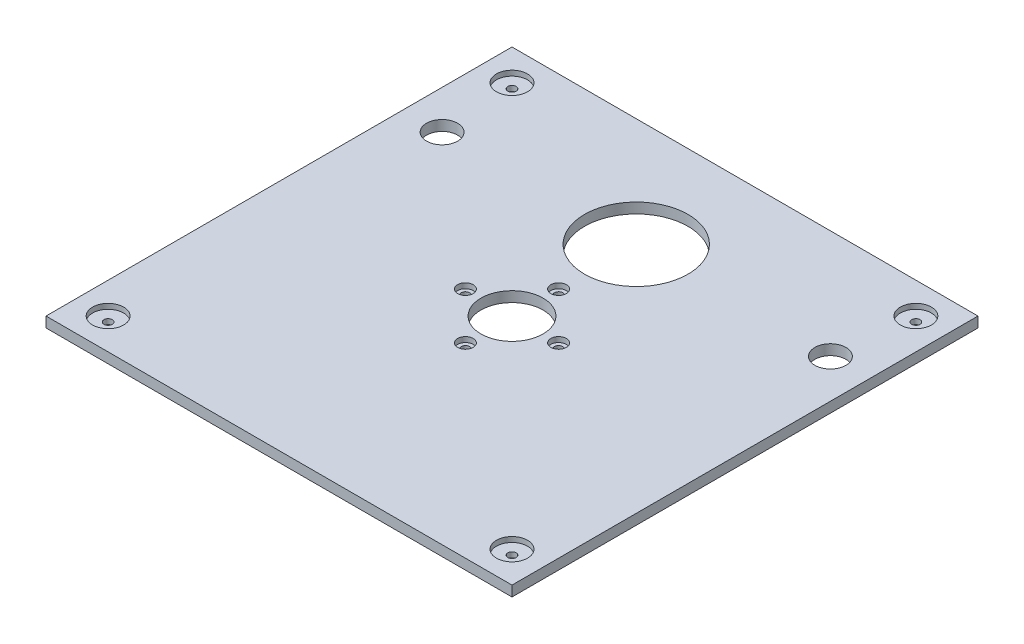
ISO-10303-21;
HEADER;
FILE_DESCRIPTION(('STEP AP214'),'2;1');
FILE_NAME('part.step','',(''),(''),'','','');
FILE_SCHEMA(('AUTOMOTIVE_DESIGN { 1 0 10303 214 1 1 1 1 }'));
ENDSEC;
DATA;
#1=APPLICATION_CONTEXT('core data for automotive mechanical design processes');
#2=APPLICATION_PROTOCOL_DEFINITION('international standard','automotive_design',2000,#1);
#3=PRODUCT_CONTEXT('',#1,'mechanical');
#4=PRODUCT('Part','Part','',(#3));
#5=PRODUCT_RELATED_PRODUCT_CATEGORY('part','',(#4));
#6=PRODUCT_DEFINITION_FORMATION('','',#4);
#7=PRODUCT_DEFINITION_CONTEXT('part definition',#1,'design');
#8=PRODUCT_DEFINITION('design','',#6,#7);
#9=PRODUCT_DEFINITION_SHAPE('','',#8);
#10=(LENGTH_UNIT() NAMED_UNIT(*) SI_UNIT(.MILLI.,.METRE.));
#11=(NAMED_UNIT(*) PLANE_ANGLE_UNIT() SI_UNIT($,.RADIAN.));
#12=(NAMED_UNIT(*) SI_UNIT($,.STERADIAN.) SOLID_ANGLE_UNIT());
#13=UNCERTAINTY_MEASURE_WITH_UNIT(LENGTH_MEASURE(1.E-05),#10,'distance_accuracy_value','');
#14=(GEOMETRIC_REPRESENTATION_CONTEXT(3) GLOBAL_UNCERTAINTY_ASSIGNED_CONTEXT((#13)) GLOBAL_UNIT_ASSIGNED_CONTEXT((#10,
#11,#12)) REPRESENTATION_CONTEXT('',''));
#15=CARTESIAN_POINT('',(0.,0.,0.));
#16=DIRECTION('',(0.,0.,1.));
#17=DIRECTION('',(1.,0.,0.));
#18=AXIS2_PLACEMENT_3D('',#15,#16,#17);
#19=CARTESIAN_POINT('',(0.,10.,0.));
#20=DIRECTION('',(0.,-1.,0.));
#21=DIRECTION('',(0.,0.,-1.));
#22=AXIS2_PLACEMENT_3D('',#19,#20,#21);
#23=PLANE('',#22);
#24=CARTESIAN_POINT('',(195.,10.,-195.));
#25=DIRECTION('',(0.,1.,0.));
#26=DIRECTION('',(0.,0.,1.));
#27=AXIS2_PLACEMENT_3D('',#24,#25,#26);
#28=CIRCLE('',#27,15.);
#29=CARTESIAN_POINT('',(195.,10.,-180.));
#30=VERTEX_POINT('',#29);
#31=EDGE_CURVE('E174',#30,#30,#28,.T.);
#32=ORIENTED_EDGE('',*,*,#31,.F.);
#33=EDGE_LOOP('',(#32));
#34=FACE_BOUND('',#33,.T.);
#35=CARTESIAN_POINT('',(195.,10.,195.));
#36=DIRECTION('',(0.,1.,0.));
#37=DIRECTION('',(0.,0.,1.));
#38=AXIS2_PLACEMENT_3D('',#35,#36,#37);
#39=CIRCLE('',#38,15.);
#40=CARTESIAN_POINT('',(195.,10.,210.));
#41=VERTEX_POINT('',#40);
#42=EDGE_CURVE('E199',#41,#41,#39,.T.);
#43=ORIENTED_EDGE('',*,*,#42,.F.);
#44=EDGE_LOOP('',(#43));
#45=FACE_BOUND('',#44,.T.);
#46=CARTESIAN_POINT('',(-195.,10.,195.));
#47=DIRECTION('',(0.,1.,0.));
#48=DIRECTION('',(0.,0.,1.));
#49=AXIS2_PLACEMENT_3D('',#46,#47,#48);
#50=CIRCLE('',#49,15.);
#51=CARTESIAN_POINT('',(-195.,10.,210.));
#52=VERTEX_POINT('',#51);
#53=EDGE_CURVE('E191',#52,#52,#50,.T.);
#54=ORIENTED_EDGE('',*,*,#53,.F.);
#55=EDGE_LOOP('',(#54));
#56=FACE_BOUND('',#55,.T.);
#57=CARTESIAN_POINT('',(-45.,10.,0.));
#58=DIRECTION('',(0.,1.,0.));
#59=DIRECTION('',(0.,0.,1.));
#60=AXIS2_PLACEMENT_3D('',#57,#58,#59);
#61=CIRCLE('',#60,7.50000000000001);
#62=CARTESIAN_POINT('',(-45.,10.,7.50000000000001));
#63=VERTEX_POINT('',#62);
#64=EDGE_CURVE('E182',#63,#63,#61,.T.);
#65=ORIENTED_EDGE('',*,*,#64,.F.);
#66=EDGE_LOOP('',(#65));
#67=FACE_BOUND('',#66,.T.);
#68=CARTESIAN_POINT('',(0.,10.,-45.));
#69=DIRECTION('',(0.,1.,0.));
#70=DIRECTION('',(0.,0.,1.));
#71=AXIS2_PLACEMENT_3D('',#68,#69,#70);
#72=CIRCLE('',#71,7.5);
#73=CARTESIAN_POINT('',(0.,10.,-37.5));
#74=VERTEX_POINT('',#73);
#75=EDGE_CURVE('E183',#74,#74,#72,.T.);
#76=ORIENTED_EDGE('',*,*,#75,.F.);
#77=EDGE_LOOP('',(#76));
#78=FACE_BOUND('',#77,.T.);
#79=CARTESIAN_POINT('',(0.,10.,45.));
#80=DIRECTION('',(0.,1.,0.));
#81=DIRECTION('',(0.,0.,1.));
#82=AXIS2_PLACEMENT_3D('',#79,#80,#81);
#83=CIRCLE('',#82,7.5);
#84=CARTESIAN_POINT('',(0.,10.,52.5));
#85=VERTEX_POINT('',#84);
#86=EDGE_CURVE('E223',#85,#85,#83,.T.);
#87=ORIENTED_EDGE('',*,*,#86,.F.);
#88=EDGE_LOOP('',(#87));
#89=FACE_BOUND('',#88,.T.);
#90=CARTESIAN_POINT('',(45.,10.,0.));
#91=DIRECTION('',(0.,1.,0.));
#92=DIRECTION('',(0.,0.,1.));
#93=AXIS2_PLACEMENT_3D('',#90,#91,#92);
#94=CIRCLE('',#93,7.50000000000001);
#95=CARTESIAN_POINT('',(45.,10.,7.50000000000001));
#96=VERTEX_POINT('',#95);
#97=EDGE_CURVE('E214',#96,#96,#94,.T.);
#98=ORIENTED_EDGE('',*,*,#97,.F.);
#99=EDGE_LOOP('',(#98));
#100=FACE_BOUND('',#99,.T.);
#101=CARTESIAN_POINT('',(-195.,10.,-195.));
#102=DIRECTION('',(0.,1.,0.));
#103=DIRECTION('',(0.,0.,1.));
#104=AXIS2_PLACEMENT_3D('',#101,#102,#103);
#105=CIRCLE('',#104,15.);
#106=CARTESIAN_POINT('',(-195.,10.,-180.));
#107=VERTEX_POINT('',#106);
#108=EDGE_CURVE('E170',#107,#107,#105,.T.);
#109=ORIENTED_EDGE('',*,*,#108,.F.);
#110=EDGE_LOOP('',(#109));
#111=FACE_BOUND('',#110,.T.);
#112=DIRECTION('',(0.,0.,-1.));
#113=VECTOR('',#112,1.);
#114=CARTESIAN_POINT('',(225.,10.,225.));
#115=LINE('',#114,#113);
#116=CARTESIAN_POINT('',(225.,10.,225.));
#117=VERTEX_POINT('',#116);
#118=CARTESIAN_POINT('',(225.,10.,-225.));
#119=VERTEX_POINT('',#118);
#120=EDGE_CURVE('E100',#117,#119,#115,.T.);
#121=ORIENTED_EDGE('',*,*,#120,.T.);
#122=DIRECTION('',(-1.,0.,0.));
#123=VECTOR('',#122,1.);
#124=CARTESIAN_POINT('',(-225.,10.,-225.));
#125=LINE('',#124,#123);
#126=CARTESIAN_POINT('',(-225.,10.,-225.));
#127=VERTEX_POINT('',#126);
#128=EDGE_CURVE('E95',#119,#127,#125,.T.);
#129=ORIENTED_EDGE('',*,*,#128,.T.);
#130=DIRECTION('',(0.,0.,1.));
#131=VECTOR('',#130,1.);
#132=CARTESIAN_POINT('',(-225.,10.,225.));
#133=LINE('',#132,#131);
#134=CARTESIAN_POINT('',(-225.,10.,225.));
#135=VERTEX_POINT('',#134);
#136=EDGE_CURVE('E98',#127,#135,#133,.T.);
#137=ORIENTED_EDGE('',*,*,#136,.T.);
#138=DIRECTION('',(1.,0.,0.));
#139=VECTOR('',#138,1.);
#140=CARTESIAN_POINT('',(-225.,10.,225.));
#141=LINE('',#140,#139);
#142=EDGE_CURVE('E65',#135,#117,#141,.T.);
#143=ORIENTED_EDGE('',*,*,#142,.T.);
#144=EDGE_LOOP('',(#121,#129,#137,#143));
#145=FACE_BOUND('',#144,.T.);
#146=CARTESIAN_POINT('',(0.,10.,0.));
#147=DIRECTION('',(0.,1.,0.));
#148=DIRECTION('',(0.,0.,1.));
#149=AXIS2_PLACEMENT_3D('',#146,#147,#148);
#150=CIRCLE('',#149,30.);
#151=CARTESIAN_POINT('',(0.,10.,30.));
#152=VERTEX_POINT('',#151);
#153=EDGE_CURVE('E120',#152,#152,#150,.T.);
#154=ORIENTED_EDGE('',*,*,#153,.F.);
#155=EDGE_LOOP('',(#154));
#156=FACE_BOUND('',#155,.T.);
#157=CARTESIAN_POINT('',(0.,10.,-120.));
#158=DIRECTION('',(0.,1.,0.));
#159=DIRECTION('',(0.,0.,1.));
#160=AXIS2_PLACEMENT_3D('',#157,#158,#159);
#161=CIRCLE('',#160,50.);
#162=CARTESIAN_POINT('',(0.,10.,-70.));
#163=VERTEX_POINT('',#162);
#164=EDGE_CURVE('E142',#163,#163,#161,.T.);
#165=ORIENTED_EDGE('',*,*,#164,.F.);
#166=EDGE_LOOP('',(#165));
#167=FACE_BOUND('',#166,.T.);
#168=CARTESIAN_POINT('',(-187.5,10.,-120.));
#169=DIRECTION('',(0.,1.,0.));
#170=DIRECTION('',(0.,0.,1.));
#171=AXIS2_PLACEMENT_3D('',#168,#169,#170);
#172=CIRCLE('',#171,15.);
#173=CARTESIAN_POINT('',(-187.5,10.,-105.));
#174=VERTEX_POINT('',#173);
#175=EDGE_CURVE('E150',#174,#174,#172,.T.);
#176=ORIENTED_EDGE('',*,*,#175,.F.);
#177=EDGE_LOOP('',(#176));
#178=FACE_BOUND('',#177,.T.);
#179=CARTESIAN_POINT('',(187.5,10.,-120.));
#180=DIRECTION('',(0.,1.,0.));
#181=DIRECTION('',(0.,0.,1.));
#182=AXIS2_PLACEMENT_3D('',#179,#180,#181);
#183=CIRCLE('',#182,15.);
#184=CARTESIAN_POINT('',(187.5,10.,-105.));
#185=VERTEX_POINT('',#184);
#186=EDGE_CURVE('E158',#185,#185,#183,.T.);
#187=ORIENTED_EDGE('',*,*,#186,.F.);
#188=EDGE_LOOP('',(#187));
#189=FACE_BOUND('',#188,.T.);
#190=ADVANCED_FACE('F47',(#34,#45,#56,#67,#78,#89,#100,#111,#145,#156,#167,#178,#189),#23,.F.);
#191=CARTESIAN_POINT('',(0.,0.,0.));
#192=DIRECTION('',(0.,-1.,0.));
#193=DIRECTION('',(0.,0.,-1.));
#194=AXIS2_PLACEMENT_3D('',#191,#192,#193);
#195=PLANE('',#194);
#196=CARTESIAN_POINT('',(-195.,0.,-195.));
#197=DIRECTION('',(0.,1.,0.));
#198=DIRECTION('',(0.,0.,1.));
#199=AXIS2_PLACEMENT_3D('',#196,#197,#198);
#200=CIRCLE('',#199,3.99999999999999);
#201=CARTESIAN_POINT('',(-195.,0.,-191.));
#202=VERTEX_POINT('',#201);
#203=EDGE_CURVE('E242',#202,#202,#200,.T.);
#204=ORIENTED_EDGE('',*,*,#203,.T.);
#205=EDGE_LOOP('',(#204));
#206=FACE_BOUND('',#205,.T.);
#207=CARTESIAN_POINT('',(195.,0.,-195.));
#208=DIRECTION('',(0.,1.,0.));
#209=DIRECTION('',(0.,0.,1.));
#210=AXIS2_PLACEMENT_3D('',#207,#208,#209);
#211=CIRCLE('',#210,3.99999999999999);
#212=CARTESIAN_POINT('',(195.,0.,-191.));
#213=VERTEX_POINT('',#212);
#214=EDGE_CURVE('E250',#213,#213,#211,.T.);
#215=ORIENTED_EDGE('',*,*,#214,.T.);
#216=EDGE_LOOP('',(#215));
#217=FACE_BOUND('',#216,.T.);
#218=CARTESIAN_POINT('',(0.,0.,-45.));
#219=DIRECTION('',(0.,1.,0.));
#220=DIRECTION('',(0.,0.,1.));
#221=AXIS2_PLACEMENT_3D('',#218,#219,#220);
#222=CIRCLE('',#221,4.);
#223=CARTESIAN_POINT('',(0.,0.,-41.));
#224=VERTEX_POINT('',#223);
#225=EDGE_CURVE('E258',#224,#224,#222,.T.);
#226=ORIENTED_EDGE('',*,*,#225,.T.);
#227=EDGE_LOOP('',(#226));
#228=FACE_BOUND('',#227,.T.);
#229=CARTESIAN_POINT('',(0.,0.,45.));
#230=DIRECTION('',(0.,1.,0.));
#231=DIRECTION('',(0.,0.,1.));
#232=AXIS2_PLACEMENT_3D('',#229,#230,#231);
#233=CIRCLE('',#232,4.);
#234=CARTESIAN_POINT('',(0.,0.,49.));
#235=VERTEX_POINT('',#234);
#236=EDGE_CURVE('E266',#235,#235,#233,.T.);
#237=ORIENTED_EDGE('',*,*,#236,.T.);
#238=EDGE_LOOP('',(#237));
#239=FACE_BOUND('',#238,.T.);
#240=CARTESIAN_POINT('',(45.,0.,0.));
#241=DIRECTION('',(0.,1.,0.));
#242=DIRECTION('',(0.,0.,1.));
#243=AXIS2_PLACEMENT_3D('',#240,#241,#242);
#244=CIRCLE('',#243,4.00000000000001);
#245=CARTESIAN_POINT('',(45.,0.,4.00000000000001));
#246=VERTEX_POINT('',#245);
#247=EDGE_CURVE('E274',#246,#246,#244,.T.);
#248=ORIENTED_EDGE('',*,*,#247,.T.);
#249=EDGE_LOOP('',(#248));
#250=FACE_BOUND('',#249,.T.);
#251=CARTESIAN_POINT('',(-45.,0.,0.));
#252=DIRECTION('',(0.,1.,0.));
#253=DIRECTION('',(0.,0.,1.));
#254=AXIS2_PLACEMENT_3D('',#251,#252,#253);
#255=CIRCLE('',#254,4.00000000000001);
#256=CARTESIAN_POINT('',(-45.,0.,4.00000000000001));
#257=VERTEX_POINT('',#256);
#258=EDGE_CURVE('E282',#257,#257,#255,.T.);
#259=ORIENTED_EDGE('',*,*,#258,.T.);
#260=EDGE_LOOP('',(#259));
#261=FACE_BOUND('',#260,.T.);
#262=CARTESIAN_POINT('',(-195.,0.,195.));
#263=DIRECTION('',(0.,1.,0.));
#264=DIRECTION('',(0.,0.,1.));
#265=AXIS2_PLACEMENT_3D('',#262,#263,#264);
#266=CIRCLE('',#265,3.99999999999999);
#267=CARTESIAN_POINT('',(-195.,0.,199.));
#268=VERTEX_POINT('',#267);
#269=EDGE_CURVE('E290',#268,#268,#266,.T.);
#270=ORIENTED_EDGE('',*,*,#269,.T.);
#271=EDGE_LOOP('',(#270));
#272=FACE_BOUND('',#271,.T.);
#273=CARTESIAN_POINT('',(195.,0.,195.));
#274=DIRECTION('',(0.,1.,0.));
#275=DIRECTION('',(0.,0.,1.));
#276=AXIS2_PLACEMENT_3D('',#273,#274,#275);
#277=CIRCLE('',#276,3.99999999999999);
#278=CARTESIAN_POINT('',(195.,0.,199.));
#279=VERTEX_POINT('',#278);
#280=EDGE_CURVE('E215',#279,#279,#277,.T.);
#281=ORIENTED_EDGE('',*,*,#280,.T.);
#282=EDGE_LOOP('',(#281));
#283=FACE_BOUND('',#282,.T.);
#284=CARTESIAN_POINT('',(-187.5,0.,-120.));
#285=DIRECTION('',(0.,1.,0.));
#286=DIRECTION('',(0.,0.,1.));
#287=AXIS2_PLACEMENT_3D('',#284,#285,#286);
#288=CIRCLE('',#287,15.);
#289=CARTESIAN_POINT('',(-187.5,0.,-105.));
#290=VERTEX_POINT('',#289);
#291=EDGE_CURVE('E154',#290,#290,#288,.T.);
#292=ORIENTED_EDGE('',*,*,#291,.T.);
#293=EDGE_LOOP('',(#292));
#294=FACE_BOUND('',#293,.T.);
#295=CARTESIAN_POINT('',(0.,0.,0.));
#296=DIRECTION('',(0.,1.,0.));
#297=DIRECTION('',(0.,0.,1.));
#298=AXIS2_PLACEMENT_3D('',#295,#296,#297);
#299=CIRCLE('',#298,30.);
#300=CARTESIAN_POINT('',(0.,0.,30.));
#301=VERTEX_POINT('',#300);
#302=EDGE_CURVE('E138',#301,#301,#299,.T.);
#303=ORIENTED_EDGE('',*,*,#302,.T.);
#304=EDGE_LOOP('',(#303));
#305=FACE_BOUND('',#304,.T.);
#306=DIRECTION('',(0.,0.,-1.));
#307=VECTOR('',#306,1.);
#308=CARTESIAN_POINT('',(225.,0.,225.));
#309=LINE('',#308,#307);
#310=CARTESIAN_POINT('',(225.,0.,225.));
#311=VERTEX_POINT('',#310);
#312=CARTESIAN_POINT('',(225.,0.,-225.));
#313=VERTEX_POINT('',#312);
#314=EDGE_CURVE('E116',#311,#313,#309,.T.);
#315=ORIENTED_EDGE('',*,*,#314,.F.);
#316=DIRECTION('',(1.,0.,0.));
#317=VECTOR('',#316,1.);
#318=CARTESIAN_POINT('',(-225.,0.,225.));
#319=LINE('',#318,#317);
#320=CARTESIAN_POINT('',(-225.,0.,225.));
#321=VERTEX_POINT('',#320);
#322=EDGE_CURVE('E88',#321,#311,#319,.T.);
#323=ORIENTED_EDGE('',*,*,#322,.F.);
#324=DIRECTION('',(0.,0.,1.));
#325=VECTOR('',#324,1.);
#326=CARTESIAN_POINT('',(-225.,0.,225.));
#327=LINE('',#326,#325);
#328=CARTESIAN_POINT('',(-225.,0.,-225.));
#329=VERTEX_POINT('',#328);
#330=EDGE_CURVE('E82',#329,#321,#327,.T.);
#331=ORIENTED_EDGE('',*,*,#330,.F.);
#332=DIRECTION('',(-1.,0.,0.));
#333=VECTOR('',#332,1.);
#334=CARTESIAN_POINT('',(-225.,0.,-225.));
#335=LINE('',#334,#333);
#336=EDGE_CURVE('E105',#313,#329,#335,.T.);
#337=ORIENTED_EDGE('',*,*,#336,.F.);
#338=EDGE_LOOP('',(#315,#323,#331,#337));
#339=FACE_BOUND('',#338,.T.);
#340=CARTESIAN_POINT('',(0.,0.,-120.));
#341=DIRECTION('',(0.,1.,0.));
#342=DIRECTION('',(0.,0.,1.));
#343=AXIS2_PLACEMENT_3D('',#340,#341,#342);
#344=CIRCLE('',#343,50.);
#345=CARTESIAN_POINT('',(0.,0.,-70.));
#346=VERTEX_POINT('',#345);
#347=EDGE_CURVE('E146',#346,#346,#344,.T.);
#348=ORIENTED_EDGE('',*,*,#347,.T.);
#349=EDGE_LOOP('',(#348));
#350=FACE_BOUND('',#349,.T.);
#351=CARTESIAN_POINT('',(187.5,0.,-120.));
#352=DIRECTION('',(0.,1.,0.));
#353=DIRECTION('',(0.,0.,1.));
#354=AXIS2_PLACEMENT_3D('',#351,#352,#353);
#355=CIRCLE('',#354,15.);
#356=CARTESIAN_POINT('',(187.5,0.,-105.));
#357=VERTEX_POINT('',#356);
#358=EDGE_CURVE('E162',#357,#357,#355,.T.);
#359=ORIENTED_EDGE('',*,*,#358,.T.);
#360=EDGE_LOOP('',(#359));
#361=FACE_BOUND('',#360,.T.);
#362=ADVANCED_FACE('F133',(#206,#217,#228,#239,#250,#261,#272,#283,#294,#305,#339,#350,#361),
#195,.T.);
#363=CARTESIAN_POINT('',(225.,10.,225.));
#364=DIRECTION('',(-1.,0.,0.));
#365=DIRECTION('',(0.,0.,1.));
#366=AXIS2_PLACEMENT_3D('',#363,#364,#365);
#367=PLANE('',#366);
#368=ORIENTED_EDGE('',*,*,#314,.T.);
#369=DIRECTION('',(0.,-1.,0.));
#370=VECTOR('',#369,1.);
#371=CARTESIAN_POINT('',(225.,10.,-225.));
#372=LINE('',#371,#370);
#373=EDGE_CURVE('E11',#119,#313,#372,.T.);
#374=ORIENTED_EDGE('',*,*,#373,.F.);
#375=ORIENTED_EDGE('',*,*,#120,.F.);
#376=DIRECTION('',(0.,-1.,0.));
#377=VECTOR('',#376,1.);
#378=CARTESIAN_POINT('',(225.,10.,225.));
#379=LINE('',#378,#377);
#380=EDGE_CURVE('E112',#117,#311,#379,.T.);
#381=ORIENTED_EDGE('',*,*,#380,.T.);
#382=EDGE_LOOP('',(#368,#374,#375,#381));
#383=FACE_BOUND('',#382,.T.);
#384=ADVANCED_FACE('F49',(#383),#367,.F.);
#385=CARTESIAN_POINT('',(-225.,10.,-225.));
#386=DIRECTION('',(0.,0.,1.));
#387=DIRECTION('',(1.,0.,0.));
#388=AXIS2_PLACEMENT_3D('',#385,#386,#387);
#389=PLANE('',#388);
#390=ORIENTED_EDGE('',*,*,#336,.T.);
#391=DIRECTION('',(0.,-1.,0.));
#392=VECTOR('',#391,1.);
#393=CARTESIAN_POINT('',(-225.,10.,-225.));
#394=LINE('',#393,#392);
#395=EDGE_CURVE('E57',#127,#329,#394,.T.);
#396=ORIENTED_EDGE('',*,*,#395,.F.);
#397=ORIENTED_EDGE('',*,*,#128,.F.);
#398=ORIENTED_EDGE('',*,*,#373,.T.);
#399=EDGE_LOOP('',(#390,#396,#397,#398));
#400=FACE_BOUND('',#399,.T.);
#401=ADVANCED_FACE('F104',(#400),#389,.F.);
#402=CARTESIAN_POINT('',(-225.,10.,225.));
#403=DIRECTION('',(1.,0.,0.));
#404=DIRECTION('',(0.,0.,-1.));
#405=AXIS2_PLACEMENT_3D('',#402,#403,#404);
#406=PLANE('',#405);
#407=ORIENTED_EDGE('',*,*,#330,.T.);
#408=DIRECTION('',(0.,-1.,0.));
#409=VECTOR('',#408,1.);
#410=CARTESIAN_POINT('',(-225.,10.,225.));
#411=LINE('',#410,#409);
#412=EDGE_CURVE('E107',#135,#321,#411,.T.);
#413=ORIENTED_EDGE('',*,*,#412,.F.);
#414=ORIENTED_EDGE('',*,*,#136,.F.);
#415=ORIENTED_EDGE('',*,*,#395,.T.);
#416=EDGE_LOOP('',(#407,#413,#414,#415));
#417=FACE_BOUND('',#416,.T.);
#418=ADVANCED_FACE('F108',(#417),#406,.F.);
#419=CARTESIAN_POINT('',(-225.,10.,225.));
#420=DIRECTION('',(0.,0.,-1.));
#421=DIRECTION('',(-1.,0.,0.));
#422=AXIS2_PLACEMENT_3D('',#419,#420,#421);
#423=PLANE('',#422);
#424=ORIENTED_EDGE('',*,*,#322,.T.);
#425=ORIENTED_EDGE('',*,*,#380,.F.);
#426=ORIENTED_EDGE('',*,*,#142,.F.);
#427=ORIENTED_EDGE('',*,*,#412,.T.);
#428=EDGE_LOOP('',(#424,#425,#426,#427));
#429=FACE_BOUND('',#428,.T.);
#430=ADVANCED_FACE('F130',(#429),#423,.F.);
#431=CARTESIAN_POINT('',(0.,10.,0.));
#432=DIRECTION('',(0.,-1.,0.));
#433=DIRECTION('',(0.,0.,-1.));
#434=AXIS2_PLACEMENT_3D('',#431,#432,#433);
#435=CYLINDRICAL_SURFACE('',#434,30.);
#436=ORIENTED_EDGE('',*,*,#153,.T.);
#437=EDGE_LOOP('',(#436));
#438=FACE_BOUND('',#437,.T.);
#439=ORIENTED_EDGE('',*,*,#302,.F.);
#440=EDGE_LOOP('',(#439));
#441=FACE_BOUND('',#440,.T.);
#442=ADVANCED_FACE('F354',(#438,#441),#435,.F.);
#443=CARTESIAN_POINT('',(0.,10.,-120.));
#444=DIRECTION('',(0.,-1.,0.));
#445=DIRECTION('',(0.,0.,-1.));
#446=AXIS2_PLACEMENT_3D('',#443,#444,#445);
#447=CYLINDRICAL_SURFACE('',#446,50.);
#448=ORIENTED_EDGE('',*,*,#164,.T.);
#449=EDGE_LOOP('',(#448));
#450=FACE_BOUND('',#449,.T.);
#451=ORIENTED_EDGE('',*,*,#347,.F.);
#452=EDGE_LOOP('',(#451));
#453=FACE_BOUND('',#452,.T.);
#454=ADVANCED_FACE('F350',(#450,#453),#447,.F.);
#455=CARTESIAN_POINT('',(-187.5,10.,-120.));
#456=DIRECTION('',(0.,-1.,0.));
#457=DIRECTION('',(0.,0.,-1.));
#458=AXIS2_PLACEMENT_3D('',#455,#456,#457);
#459=CYLINDRICAL_SURFACE('',#458,15.);
#460=ORIENTED_EDGE('',*,*,#175,.T.);
#461=EDGE_LOOP('',(#460));
#462=FACE_BOUND('',#461,.T.);
#463=ORIENTED_EDGE('',*,*,#291,.F.);
#464=EDGE_LOOP('',(#463));
#465=FACE_BOUND('',#464,.T.);
#466=ADVANCED_FACE('F342',(#462,#465),#459,.F.);
#467=CARTESIAN_POINT('',(187.5,10.,-120.));
#468=DIRECTION('',(0.,-1.,0.));
#469=DIRECTION('',(0.,0.,-1.));
#470=AXIS2_PLACEMENT_3D('',#467,#468,#469);
#471=CYLINDRICAL_SURFACE('',#470,15.);
#472=ORIENTED_EDGE('',*,*,#186,.T.);
#473=EDGE_LOOP('',(#472));
#474=FACE_BOUND('',#473,.T.);
#475=ORIENTED_EDGE('',*,*,#358,.F.);
#476=EDGE_LOOP('',(#475));
#477=FACE_BOUND('',#476,.T.);
#478=ADVANCED_FACE('F331',(#474,#477),#471,.F.);
#479=CARTESIAN_POINT('',(-195.,5.,-195.));
#480=DIRECTION('',(0.,1.,0.));
#481=DIRECTION('',(0.,0.,1.));
#482=AXIS2_PLACEMENT_3D('',#479,#480,#481);
#483=CYLINDRICAL_SURFACE('',#482,15.);
#484=CARTESIAN_POINT('',(-195.,5.,-195.));
#485=DIRECTION('',(0.,1.,0.));
#486=DIRECTION('',(0.,0.,1.));
#487=AXIS2_PLACEMENT_3D('',#484,#485,#486);
#488=CIRCLE('',#487,15.);
#489=CARTESIAN_POINT('',(-195.,5.,-180.));
#490=VERTEX_POINT('',#489);
#491=EDGE_CURVE('E166',#490,#490,#488,.T.);
#492=ORIENTED_EDGE('',*,*,#491,.F.);
#493=EDGE_LOOP('',(#492));
#494=FACE_BOUND('',#493,.T.);
#495=ORIENTED_EDGE('',*,*,#108,.T.);
#496=EDGE_LOOP('',(#495));
#497=FACE_BOUND('',#496,.T.);
#498=ADVANCED_FACE('F328',(#494,#497),#483,.F.);
#499=CARTESIAN_POINT('',(-195.,5.,-195.));
#500=DIRECTION('',(0.,1.,0.));
#501=DIRECTION('',(0.,0.,1.));
#502=AXIS2_PLACEMENT_3D('',#499,#500,#501);
#503=PLANE('',#502);
#504=CARTESIAN_POINT('',(-195.,5.,-195.));
#505=DIRECTION('',(0.,1.,0.));
#506=DIRECTION('',(0.,0.,1.));
#507=AXIS2_PLACEMENT_3D('',#504,#505,#506);
#508=CIRCLE('',#507,3.99999999999999);
#509=CARTESIAN_POINT('',(-195.,5.,-191.));
#510=VERTEX_POINT('',#509);
#511=EDGE_CURVE('E246',#510,#510,#508,.T.);
#512=ORIENTED_EDGE('',*,*,#511,.F.);
#513=EDGE_LOOP('',(#512));
#514=FACE_BOUND('',#513,.T.);
#515=ORIENTED_EDGE('',*,*,#491,.T.);
#516=EDGE_LOOP('',(#515));
#517=FACE_BOUND('',#516,.T.);
#518=ADVANCED_FACE('F330',(#514,#517),#503,.T.);
#519=CARTESIAN_POINT('',(45.,5.,0.));
#520=DIRECTION('',(0.,1.,0.));
#521=DIRECTION('',(0.,0.,1.));
#522=AXIS2_PLACEMENT_3D('',#519,#520,#521);
#523=CYLINDRICAL_SURFACE('',#522,7.50000000000001);
#524=CARTESIAN_POINT('',(45.,5.,0.));
#525=DIRECTION('',(0.,1.,0.));
#526=DIRECTION('',(0.,0.,1.));
#527=AXIS2_PLACEMENT_3D('',#524,#525,#526);
#528=CIRCLE('',#527,7.50000000000001);
#529=CARTESIAN_POINT('',(45.,5.,7.50000000000001));
#530=VERTEX_POINT('',#529);
#531=EDGE_CURVE('E210',#530,#530,#528,.T.);
#532=ORIENTED_EDGE('',*,*,#531,.F.);
#533=EDGE_LOOP('',(#532));
#534=FACE_BOUND('',#533,.T.);
#535=ORIENTED_EDGE('',*,*,#97,.T.);
#536=EDGE_LOOP('',(#535));
#537=FACE_BOUND('',#536,.T.);
#538=ADVANCED_FACE('F338',(#534,#537),#523,.F.);
#539=CARTESIAN_POINT('',(45.,5.,0.));
#540=DIRECTION('',(0.,1.,0.));
#541=DIRECTION('',(0.,0.,1.));
#542=AXIS2_PLACEMENT_3D('',#539,#540,#541);
#543=PLANE('',#542);
#544=CARTESIAN_POINT('',(45.,5.,0.));
#545=DIRECTION('',(0.,1.,0.));
#546=DIRECTION('',(0.,0.,1.));
#547=AXIS2_PLACEMENT_3D('',#544,#545,#546);
#548=CIRCLE('',#547,4.00000000000001);
#549=CARTESIAN_POINT('',(45.,5.,4.00000000000001));
#550=VERTEX_POINT('',#549);
#551=EDGE_CURVE('E278',#550,#550,#548,.T.);
#552=ORIENTED_EDGE('',*,*,#551,.F.);
#553=EDGE_LOOP('',(#552));
#554=FACE_BOUND('',#553,.T.);
#555=ORIENTED_EDGE('',*,*,#531,.T.);
#556=EDGE_LOOP('',(#555));
#557=FACE_BOUND('',#556,.T.);
#558=ADVANCED_FACE('F436',(#554,#557),#543,.T.);
#559=CARTESIAN_POINT('',(0.,5.,45.));
#560=DIRECTION('',(0.,1.,0.));
#561=DIRECTION('',(0.,0.,1.));
#562=AXIS2_PLACEMENT_3D('',#559,#560,#561);
#563=CYLINDRICAL_SURFACE('',#562,7.5);
#564=CARTESIAN_POINT('',(0.,5.,45.));
#565=DIRECTION('',(0.,1.,0.));
#566=DIRECTION('',(0.,0.,1.));
#567=AXIS2_PLACEMENT_3D('',#564,#565,#566);
#568=CIRCLE('',#567,7.5);
#569=CARTESIAN_POINT('',(0.,5.,52.5));
#570=VERTEX_POINT('',#569);
#571=EDGE_CURVE('E219',#570,#570,#568,.T.);
#572=ORIENTED_EDGE('',*,*,#571,.F.);
#573=EDGE_LOOP('',(#572));
#574=FACE_BOUND('',#573,.T.);
#575=ORIENTED_EDGE('',*,*,#86,.T.);
#576=EDGE_LOOP('',(#575));
#577=FACE_BOUND('',#576,.T.);
#578=ADVANCED_FACE('F446',(#574,#577),#563,.F.);
#579=CARTESIAN_POINT('',(0.,5.,45.));
#580=DIRECTION('',(0.,1.,0.));
#581=DIRECTION('',(0.,0.,1.));
#582=AXIS2_PLACEMENT_3D('',#579,#580,#581);
#583=PLANE('',#582);
#584=CARTESIAN_POINT('',(0.,5.,45.));
#585=DIRECTION('',(0.,1.,0.));
#586=DIRECTION('',(0.,0.,1.));
#587=AXIS2_PLACEMENT_3D('',#584,#585,#586);
#588=CIRCLE('',#587,4.);
#589=CARTESIAN_POINT('',(0.,5.,49.));
#590=VERTEX_POINT('',#589);
#591=EDGE_CURVE('E270',#590,#590,#588,.T.);
#592=ORIENTED_EDGE('',*,*,#591,.F.);
#593=EDGE_LOOP('',(#592));
#594=FACE_BOUND('',#593,.T.);
#595=ORIENTED_EDGE('',*,*,#571,.T.);
#596=EDGE_LOOP('',(#595));
#597=FACE_BOUND('',#596,.T.);
#598=ADVANCED_FACE('F456',(#594,#597),#583,.T.);
#599=CARTESIAN_POINT('',(0.,5.,-45.));
#600=DIRECTION('',(0.,1.,0.));
#601=DIRECTION('',(0.,0.,1.));
#602=AXIS2_PLACEMENT_3D('',#599,#600,#601);
#603=CYLINDRICAL_SURFACE('',#602,7.5);
#604=CARTESIAN_POINT('',(0.,5.,-45.));
#605=DIRECTION('',(0.,1.,0.));
#606=DIRECTION('',(0.,0.,1.));
#607=AXIS2_PLACEMENT_3D('',#604,#605,#606);
#608=CIRCLE('',#607,7.5);
#609=CARTESIAN_POINT('',(0.,5.,-37.5));
#610=VERTEX_POINT('',#609);
#611=EDGE_CURVE('E227',#610,#610,#608,.T.);
#612=ORIENTED_EDGE('',*,*,#611,.F.);
#613=EDGE_LOOP('',(#612));
#614=FACE_BOUND('',#613,.T.);
#615=ORIENTED_EDGE('',*,*,#75,.T.);
#616=EDGE_LOOP('',(#615));
#617=FACE_BOUND('',#616,.T.);
#618=ADVANCED_FACE('F466',(#614,#617),#603,.F.);
#619=CARTESIAN_POINT('',(0.,5.,-45.));
#620=DIRECTION('',(0.,1.,0.));
#621=DIRECTION('',(0.,0.,1.));
#622=AXIS2_PLACEMENT_3D('',#619,#620,#621);
#623=PLANE('',#622);
#624=CARTESIAN_POINT('',(0.,5.,-45.));
#625=DIRECTION('',(0.,1.,0.));
#626=DIRECTION('',(0.,0.,1.));
#627=AXIS2_PLACEMENT_3D('',#624,#625,#626);
#628=CIRCLE('',#627,4.);
#629=CARTESIAN_POINT('',(0.,5.,-41.));
#630=VERTEX_POINT('',#629);
#631=EDGE_CURVE('E262',#630,#630,#628,.T.);
#632=ORIENTED_EDGE('',*,*,#631,.F.);
#633=EDGE_LOOP('',(#632));
#634=FACE_BOUND('',#633,.T.);
#635=ORIENTED_EDGE('',*,*,#611,.T.);
#636=EDGE_LOOP('',(#635));
#637=FACE_BOUND('',#636,.T.);
#638=ADVANCED_FACE('F476',(#634,#637),#623,.T.);
#639=CARTESIAN_POINT('',(-45.,5.,0.));
#640=DIRECTION('',(0.,1.,0.));
#641=DIRECTION('',(0.,0.,1.));
#642=AXIS2_PLACEMENT_3D('',#639,#640,#641);
#643=CYLINDRICAL_SURFACE('',#642,7.50000000000001);
#644=CARTESIAN_POINT('',(-45.,5.,0.));
#645=DIRECTION('',(0.,1.,0.));
#646=DIRECTION('',(0.,0.,1.));
#647=AXIS2_PLACEMENT_3D('',#644,#645,#646);
#648=CIRCLE('',#647,7.50000000000001);
#649=CARTESIAN_POINT('',(-45.,5.,7.50000000000001));
#650=VERTEX_POINT('',#649);
#651=EDGE_CURVE('E178',#650,#650,#648,.T.);
#652=ORIENTED_EDGE('',*,*,#651,.F.);
#653=EDGE_LOOP('',(#652));
#654=FACE_BOUND('',#653,.T.);
#655=ORIENTED_EDGE('',*,*,#64,.T.);
#656=EDGE_LOOP('',(#655));
#657=FACE_BOUND('',#656,.T.);
#658=ADVANCED_FACE('F486',(#654,#657),#643,.F.);
#659=CARTESIAN_POINT('',(-45.,5.,0.));
#660=DIRECTION('',(0.,1.,0.));
#661=DIRECTION('',(0.,0.,1.));
#662=AXIS2_PLACEMENT_3D('',#659,#660,#661);
#663=PLANE('',#662);
#664=CARTESIAN_POINT('',(-45.,5.,0.));
#665=DIRECTION('',(0.,1.,0.));
#666=DIRECTION('',(0.,0.,1.));
#667=AXIS2_PLACEMENT_3D('',#664,#665,#666);
#668=CIRCLE('',#667,4.00000000000001);
#669=CARTESIAN_POINT('',(-45.,5.,4.00000000000001));
#670=VERTEX_POINT('',#669);
#671=EDGE_CURVE('E286',#670,#670,#668,.T.);
#672=ORIENTED_EDGE('',*,*,#671,.F.);
#673=EDGE_LOOP('',(#672));
#674=FACE_BOUND('',#673,.T.);
#675=ORIENTED_EDGE('',*,*,#651,.T.);
#676=EDGE_LOOP('',(#675));
#677=FACE_BOUND('',#676,.T.);
#678=ADVANCED_FACE('F310',(#674,#677),#663,.T.);
#679=CARTESIAN_POINT('',(-195.,5.,195.));
#680=DIRECTION('',(0.,1.,0.));
#681=DIRECTION('',(0.,0.,1.));
#682=AXIS2_PLACEMENT_3D('',#679,#680,#681);
#683=CYLINDRICAL_SURFACE('',#682,15.);
#684=CARTESIAN_POINT('',(-195.,5.,195.));
#685=DIRECTION('',(0.,1.,0.));
#686=DIRECTION('',(0.,0.,1.));
#687=AXIS2_PLACEMENT_3D('',#684,#685,#686);
#688=CIRCLE('',#687,15.);
#689=CARTESIAN_POINT('',(-195.,5.,210.));
#690=VERTEX_POINT('',#689);
#691=EDGE_CURVE('E187',#690,#690,#688,.T.);
#692=ORIENTED_EDGE('',*,*,#691,.F.);
#693=EDGE_LOOP('',(#692));
#694=FACE_BOUND('',#693,.T.);
#695=ORIENTED_EDGE('',*,*,#53,.T.);
#696=EDGE_LOOP('',(#695));
#697=FACE_BOUND('',#696,.T.);
#698=ADVANCED_FACE('F304',(#694,#697),#683,.F.);
#699=CARTESIAN_POINT('',(-195.,5.,195.));
#700=DIRECTION('',(0.,1.,0.));
#701=DIRECTION('',(0.,0.,1.));
#702=AXIS2_PLACEMENT_3D('',#699,#700,#701);
#703=PLANE('',#702);
#704=CARTESIAN_POINT('',(-195.,5.,195.));
#705=DIRECTION('',(0.,1.,0.));
#706=DIRECTION('',(0.,0.,1.));
#707=AXIS2_PLACEMENT_3D('',#704,#705,#706);
#708=CIRCLE('',#707,3.99999999999999);
#709=CARTESIAN_POINT('',(-195.,5.,199.));
#710=VERTEX_POINT('',#709);
#711=EDGE_CURVE('E238',#710,#710,#708,.T.);
#712=ORIENTED_EDGE('',*,*,#711,.F.);
#713=EDGE_LOOP('',(#712));
#714=FACE_BOUND('',#713,.T.);
#715=ORIENTED_EDGE('',*,*,#691,.T.);
#716=EDGE_LOOP('',(#715));
#717=FACE_BOUND('',#716,.T.);
#718=ADVANCED_FACE('F300',(#714,#717),#703,.T.);
#719=CARTESIAN_POINT('',(195.,5.,195.));
#720=DIRECTION('',(0.,1.,0.));
#721=DIRECTION('',(0.,0.,1.));
#722=AXIS2_PLACEMENT_3D('',#719,#720,#721);
#723=CYLINDRICAL_SURFACE('',#722,15.);
#724=CARTESIAN_POINT('',(195.,5.,195.));
#725=DIRECTION('',(0.,1.,0.));
#726=DIRECTION('',(0.,0.,1.));
#727=AXIS2_PLACEMENT_3D('',#724,#725,#726);
#728=CIRCLE('',#727,15.);
#729=CARTESIAN_POINT('',(195.,5.,210.));
#730=VERTEX_POINT('',#729);
#731=EDGE_CURVE('E195',#730,#730,#728,.T.);
#732=ORIENTED_EDGE('',*,*,#731,.F.);
#733=EDGE_LOOP('',(#732));
#734=FACE_BOUND('',#733,.T.);
#735=ORIENTED_EDGE('',*,*,#42,.T.);
#736=EDGE_LOOP('',(#735));
#737=FACE_BOUND('',#736,.T.);
#738=ADVANCED_FACE('F303',(#734,#737),#723,.F.);
#739=CARTESIAN_POINT('',(195.,5.,195.));
#740=DIRECTION('',(0.,1.,0.));
#741=DIRECTION('',(0.,0.,1.));
#742=AXIS2_PLACEMENT_3D('',#739,#740,#741);
#743=PLANE('',#742);
#744=CARTESIAN_POINT('',(195.,5.,195.));
#745=DIRECTION('',(0.,1.,0.));
#746=DIRECTION('',(0.,0.,1.));
#747=AXIS2_PLACEMENT_3D('',#744,#745,#746);
#748=CIRCLE('',#747,3.99999999999999);
#749=CARTESIAN_POINT('',(195.,5.,199.));
#750=VERTEX_POINT('',#749);
#751=EDGE_CURVE('E234',#750,#750,#748,.T.);
#752=ORIENTED_EDGE('',*,*,#751,.F.);
#753=EDGE_LOOP('',(#752));
#754=FACE_BOUND('',#753,.T.);
#755=ORIENTED_EDGE('',*,*,#731,.T.);
#756=EDGE_LOOP('',(#755));
#757=FACE_BOUND('',#756,.T.);
#758=ADVANCED_FACE('F525',(#754,#757),#743,.T.);
#759=CARTESIAN_POINT('',(195.,5.,-195.));
#760=DIRECTION('',(0.,1.,0.));
#761=DIRECTION('',(0.,0.,1.));
#762=AXIS2_PLACEMENT_3D('',#759,#760,#761);
#763=CYLINDRICAL_SURFACE('',#762,15.);
#764=CARTESIAN_POINT('',(195.,5.,-195.));
#765=DIRECTION('',(0.,1.,0.));
#766=DIRECTION('',(0.,0.,1.));
#767=AXIS2_PLACEMENT_3D('',#764,#765,#766);
#768=CIRCLE('',#767,15.);
#769=CARTESIAN_POINT('',(195.,5.,-180.));
#770=VERTEX_POINT('',#769);
#771=EDGE_CURVE('E203',#770,#770,#768,.T.);
#772=ORIENTED_EDGE('',*,*,#771,.F.);
#773=EDGE_LOOP('',(#772));
#774=FACE_BOUND('',#773,.T.);
#775=ORIENTED_EDGE('',*,*,#31,.T.);
#776=EDGE_LOOP('',(#775));
#777=FACE_BOUND('',#776,.T.);
#778=ADVANCED_FACE('F535',(#774,#777),#763,.F.);
#779=CARTESIAN_POINT('',(195.,5.,-195.));
#780=DIRECTION('',(0.,1.,0.));
#781=DIRECTION('',(0.,0.,1.));
#782=AXIS2_PLACEMENT_3D('',#779,#780,#781);
#783=PLANE('',#782);
#784=CARTESIAN_POINT('',(195.,5.,-195.));
#785=DIRECTION('',(0.,1.,0.));
#786=DIRECTION('',(0.,0.,1.));
#787=AXIS2_PLACEMENT_3D('',#784,#785,#786);
#788=CIRCLE('',#787,3.99999999999999);
#789=CARTESIAN_POINT('',(195.,5.,-191.));
#790=VERTEX_POINT('',#789);
#791=EDGE_CURVE('E254',#790,#790,#788,.T.);
#792=ORIENTED_EDGE('',*,*,#791,.F.);
#793=EDGE_LOOP('',(#792));
#794=FACE_BOUND('',#793,.T.);
#795=ORIENTED_EDGE('',*,*,#771,.T.);
#796=EDGE_LOOP('',(#795));
#797=FACE_BOUND('',#796,.T.);
#798=ADVANCED_FACE('F545',(#794,#797),#783,.T.);
#799=CARTESIAN_POINT('',(195.,0.,195.));
#800=DIRECTION('',(0.,1.,0.));
#801=DIRECTION('',(0.,0.,1.));
#802=AXIS2_PLACEMENT_3D('',#799,#800,#801);
#803=CYLINDRICAL_SURFACE('',#802,3.99999999999999);
#804=ORIENTED_EDGE('',*,*,#280,.F.);
#805=EDGE_LOOP('',(#804));
#806=FACE_BOUND('',#805,.T.);
#807=ORIENTED_EDGE('',*,*,#751,.T.);
#808=EDGE_LOOP('',(#807));
#809=FACE_BOUND('',#808,.T.);
#810=ADVANCED_FACE('F554',(#806,#809),#803,.F.);
#811=CARTESIAN_POINT('',(-195.,0.,195.));
#812=DIRECTION('',(0.,1.,0.));
#813=DIRECTION('',(0.,0.,1.));
#814=AXIS2_PLACEMENT_3D('',#811,#812,#813);
#815=CYLINDRICAL_SURFACE('',#814,3.99999999999999);
#816=ORIENTED_EDGE('',*,*,#269,.F.);
#817=EDGE_LOOP('',(#816));
#818=FACE_BOUND('',#817,.T.);
#819=ORIENTED_EDGE('',*,*,#711,.T.);
#820=EDGE_LOOP('',(#819));
#821=FACE_BOUND('',#820,.T.);
#822=ADVANCED_FACE('F298',(#818,#821),#815,.F.);
#823=CARTESIAN_POINT('',(-45.,0.,0.));
#824=DIRECTION('',(0.,1.,0.));
#825=DIRECTION('',(0.,0.,1.));
#826=AXIS2_PLACEMENT_3D('',#823,#824,#825);
#827=CYLINDRICAL_SURFACE('',#826,4.00000000000001);
#828=ORIENTED_EDGE('',*,*,#258,.F.);
#829=EDGE_LOOP('',(#828));
#830=FACE_BOUND('',#829,.T.);
#831=ORIENTED_EDGE('',*,*,#671,.T.);
#832=EDGE_LOOP('',(#831));
#833=FACE_BOUND('',#832,.T.);
#834=ADVANCED_FACE('F573',(#830,#833),#827,.F.);
#835=CARTESIAN_POINT('',(45.,0.,0.));
#836=DIRECTION('',(0.,1.,0.));
#837=DIRECTION('',(0.,0.,1.));
#838=AXIS2_PLACEMENT_3D('',#835,#836,#837);
#839=CYLINDRICAL_SURFACE('',#838,4.00000000000001);
#840=ORIENTED_EDGE('',*,*,#247,.F.);
#841=EDGE_LOOP('',(#840));
#842=FACE_BOUND('',#841,.T.);
#843=ORIENTED_EDGE('',*,*,#551,.T.);
#844=EDGE_LOOP('',(#843));
#845=FACE_BOUND('',#844,.T.);
#846=ADVANCED_FACE('F583',(#842,#845),#839,.F.);
#847=CARTESIAN_POINT('',(0.,0.,45.));
#848=DIRECTION('',(0.,1.,0.));
#849=DIRECTION('',(0.,0.,1.));
#850=AXIS2_PLACEMENT_3D('',#847,#848,#849);
#851=CYLINDRICAL_SURFACE('',#850,4.);
#852=ORIENTED_EDGE('',*,*,#236,.F.);
#853=EDGE_LOOP('',(#852));
#854=FACE_BOUND('',#853,.T.);
#855=ORIENTED_EDGE('',*,*,#591,.T.);
#856=EDGE_LOOP('',(#855));
#857=FACE_BOUND('',#856,.T.);
#858=ADVANCED_FACE('F593',(#854,#857),#851,.F.);
#859=CARTESIAN_POINT('',(0.,0.,-45.));
#860=DIRECTION('',(0.,1.,0.));
#861=DIRECTION('',(0.,0.,1.));
#862=AXIS2_PLACEMENT_3D('',#859,#860,#861);
#863=CYLINDRICAL_SURFACE('',#862,4.);
#864=ORIENTED_EDGE('',*,*,#225,.F.);
#865=EDGE_LOOP('',(#864));
#866=FACE_BOUND('',#865,.T.);
#867=ORIENTED_EDGE('',*,*,#631,.T.);
#868=EDGE_LOOP('',(#867));
#869=FACE_BOUND('',#868,.T.);
#870=ADVANCED_FACE('F603',(#866,#869),#863,.F.);
#871=CARTESIAN_POINT('',(195.,0.,-195.));
#872=DIRECTION('',(0.,1.,0.));
#873=DIRECTION('',(0.,0.,1.));
#874=AXIS2_PLACEMENT_3D('',#871,#872,#873);
#875=CYLINDRICAL_SURFACE('',#874,3.99999999999999);
#876=ORIENTED_EDGE('',*,*,#214,.F.);
#877=EDGE_LOOP('',(#876));
#878=FACE_BOUND('',#877,.T.);
#879=ORIENTED_EDGE('',*,*,#791,.T.);
#880=EDGE_LOOP('',(#879));
#881=FACE_BOUND('',#880,.T.);
#882=ADVANCED_FACE('F613',(#878,#881),#875,.F.);
#883=CARTESIAN_POINT('',(-195.,0.,-195.));
#884=DIRECTION('',(0.,1.,0.));
#885=DIRECTION('',(0.,0.,1.));
#886=AXIS2_PLACEMENT_3D('',#883,#884,#885);
#887=CYLINDRICAL_SURFACE('',#886,3.99999999999999);
#888=ORIENTED_EDGE('',*,*,#203,.F.);
#889=EDGE_LOOP('',(#888));
#890=FACE_BOUND('',#889,.T.);
#891=ORIENTED_EDGE('',*,*,#511,.T.);
#892=EDGE_LOOP('',(#891));
#893=FACE_BOUND('',#892,.T.);
#894=ADVANCED_FACE('F623',(#890,#893),#887,.F.);
#895=CLOSED_SHELL('',(#190,#362,#384,#401,#418,#430,#442,#454,#466,#478,#498,#518,#538,#558,
#578,#598,#618,#638,#658,#678,#698,#718,#738,#758,#778,#798,#810,#822,#834,#846,#858,#870,#882,#894));
#896=MANIFOLD_SOLID_BREP('B2',#895);
#897=ADVANCED_BREP_SHAPE_REPRESENTATION('',(#18,#896),#14);
#898=SHAPE_DEFINITION_REPRESENTATION(#9,#897);
ENDSEC;
END-ISO-10303-21;
